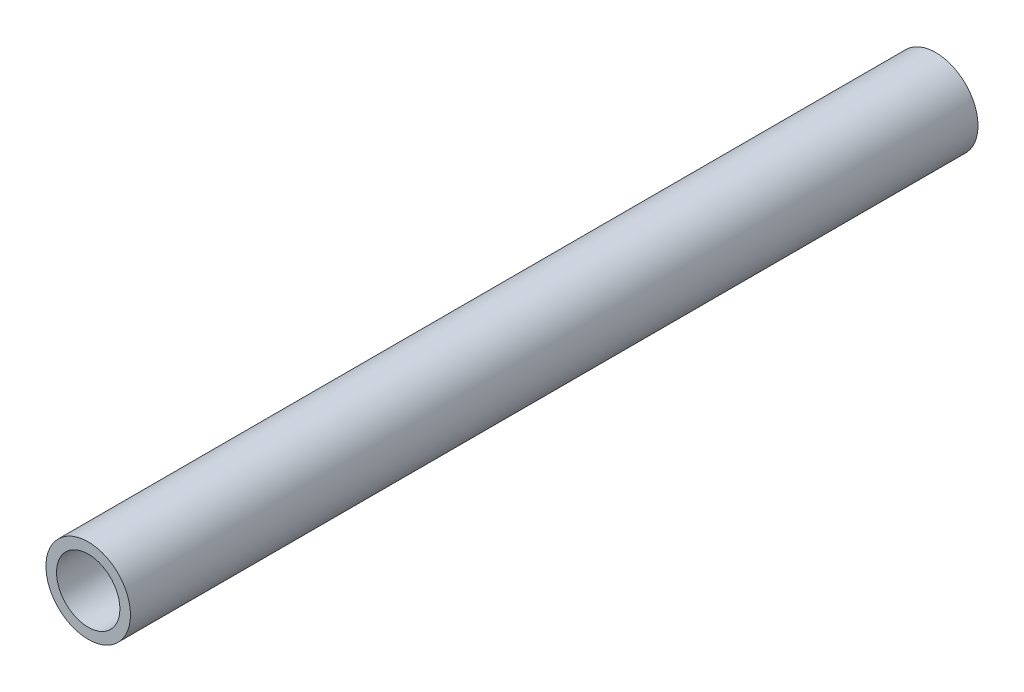
ISO-10303-21;
HEADER;
FILE_DESCRIPTION(('STEP AP214'),'2;1');
FILE_NAME('part.step','',(''),(''),'','','');
FILE_SCHEMA(('AUTOMOTIVE_DESIGN { 1 0 10303 214 1 1 1 1 }'));
ENDSEC;
DATA;
#1=APPLICATION_CONTEXT('core data for automotive mechanical design processes');
#2=APPLICATION_PROTOCOL_DEFINITION('international standard','automotive_design',2000,#1);
#3=PRODUCT_CONTEXT('',#1,'mechanical');
#4=PRODUCT('Part','Part','',(#3));
#5=PRODUCT_RELATED_PRODUCT_CATEGORY('part','',(#4));
#6=PRODUCT_DEFINITION_FORMATION('','',#4);
#7=PRODUCT_DEFINITION_CONTEXT('part definition',#1,'design');
#8=PRODUCT_DEFINITION('design','',#6,#7);
#9=PRODUCT_DEFINITION_SHAPE('','',#8);
#10=(LENGTH_UNIT() NAMED_UNIT(*) SI_UNIT(.MILLI.,.METRE.));
#11=(NAMED_UNIT(*) PLANE_ANGLE_UNIT() SI_UNIT($,.RADIAN.));
#12=(NAMED_UNIT(*) SI_UNIT($,.STERADIAN.) SOLID_ANGLE_UNIT());
#13=UNCERTAINTY_MEASURE_WITH_UNIT(LENGTH_MEASURE(1.E-05),#10,'distance_accuracy_value','');
#14=(GEOMETRIC_REPRESENTATION_CONTEXT(3) GLOBAL_UNCERTAINTY_ASSIGNED_CONTEXT((#13)) GLOBAL_UNIT_ASSIGNED_CONTEXT((#10,
#11,#12)) REPRESENTATION_CONTEXT('',''));
#15=CARTESIAN_POINT('',(0.,0.,0.));
#16=DIRECTION('',(0.,0.,1.));
#17=DIRECTION('',(1.,0.,0.));
#18=AXIS2_PLACEMENT_3D('',#15,#16,#17);
#19=CARTESIAN_POINT('',(0.,0.,1018.54));
#20=DIRECTION('',(0.,0.,1.));
#21=DIRECTION('',(1.,0.,0.));
#22=AXIS2_PLACEMENT_3D('',#19,#20,#21);
#23=PLANE('',#22);
#24=CARTESIAN_POINT('',(0.,0.,1018.54));
#25=DIRECTION('',(0.,0.,1.));
#26=DIRECTION('',(1.,0.,0.));
#27=AXIS2_PLACEMENT_3D('',#24,#25,#26);
#28=CIRCLE('',#27,50.8);
#29=CARTESIAN_POINT('',(50.8,0.,1018.54));
#30=VERTEX_POINT('',#29);
#31=EDGE_CURVE('E11',#30,#30,#28,.T.);
#32=ORIENTED_EDGE('',*,*,#31,.T.);
#33=EDGE_LOOP('',(#32));
#34=FACE_BOUND('',#33,.T.);
#35=CARTESIAN_POINT('',(0.,0.,1018.54));
#36=DIRECTION('',(0.,0.,1.));
#37=DIRECTION('',(1.,0.,0.));
#38=AXIS2_PLACEMENT_3D('',#35,#36,#37);
#39=CIRCLE('',#38,38.1);
#40=CARTESIAN_POINT('',(38.1,0.,1018.54));
#41=VERTEX_POINT('',#40);
#42=EDGE_CURVE('E48',#41,#41,#39,.T.);
#43=ORIENTED_EDGE('',*,*,#42,.F.);
#44=EDGE_LOOP('',(#43));
#45=FACE_BOUND('',#44,.T.);
#46=ADVANCED_FACE('F37',(#34,#45),#23,.T.);
#47=CARTESIAN_POINT('',(0.,0.,0.));
#48=DIRECTION('',(0.,0.,1.));
#49=DIRECTION('',(1.,0.,0.));
#50=AXIS2_PLACEMENT_3D('',#47,#48,#49);
#51=PLANE('',#50);
#52=CARTESIAN_POINT('',(0.,0.,0.));
#53=DIRECTION('',(0.,0.,1.));
#54=DIRECTION('',(1.,0.,0.));
#55=AXIS2_PLACEMENT_3D('',#52,#53,#54);
#56=CIRCLE('',#55,50.8);
#57=CARTESIAN_POINT('',(50.8,0.,0.));
#58=VERTEX_POINT('',#57);
#59=EDGE_CURVE('E41',#58,#58,#56,.T.);
#60=ORIENTED_EDGE('',*,*,#59,.F.);
#61=EDGE_LOOP('',(#60));
#62=FACE_BOUND('',#61,.T.);
#63=CARTESIAN_POINT('',(0.,0.,0.));
#64=DIRECTION('',(0.,0.,1.));
#65=DIRECTION('',(1.,0.,0.));
#66=AXIS2_PLACEMENT_3D('',#63,#64,#65);
#67=CIRCLE('',#66,38.1);
#68=CARTESIAN_POINT('',(38.1,0.,0.));
#69=VERTEX_POINT('',#68);
#70=EDGE_CURVE('E50',#69,#69,#67,.T.);
#71=ORIENTED_EDGE('',*,*,#70,.T.);
#72=EDGE_LOOP('',(#71));
#73=FACE_BOUND('',#72,.T.);
#74=ADVANCED_FACE('F60',(#62,#73),#51,.F.);
#75=CARTESIAN_POINT('',(0.,0.,1018.54));
#76=DIRECTION('',(0.,0.,-1.));
#77=DIRECTION('',(-1.,0.,0.));
#78=AXIS2_PLACEMENT_3D('',#75,#76,#77);
#79=CYLINDRICAL_SURFACE('',#78,50.8);
#80=ORIENTED_EDGE('',*,*,#31,.F.);
#81=EDGE_LOOP('',(#80));
#82=FACE_BOUND('',#81,.T.);
#83=ORIENTED_EDGE('',*,*,#59,.T.);
#84=EDGE_LOOP('',(#83));
#85=FACE_BOUND('',#84,.T.);
#86=ADVANCED_FACE('F39',(#82,#85),#79,.T.);
#87=CARTESIAN_POINT('',(0.,0.,1018.54));
#88=DIRECTION('',(0.,0.,-1.));
#89=DIRECTION('',(-1.,0.,0.));
#90=AXIS2_PLACEMENT_3D('',#87,#88,#89);
#91=CYLINDRICAL_SURFACE('',#90,38.1);
#92=ORIENTED_EDGE('',*,*,#42,.T.);
#93=EDGE_LOOP('',(#92));
#94=FACE_BOUND('',#93,.T.);
#95=ORIENTED_EDGE('',*,*,#70,.F.);
#96=EDGE_LOOP('',(#95));
#97=FACE_BOUND('',#96,.T.);
#98=ADVANCED_FACE('F56',(#94,#97),#91,.F.);
#99=CLOSED_SHELL('',(#46,#74,#86,#98));
#100=MANIFOLD_SOLID_BREP('B2',#99);
#101=ADVANCED_BREP_SHAPE_REPRESENTATION('',(#18,#100),#14);
#102=SHAPE_DEFINITION_REPRESENTATION(#9,#101);
ENDSEC;
END-ISO-10303-21;
